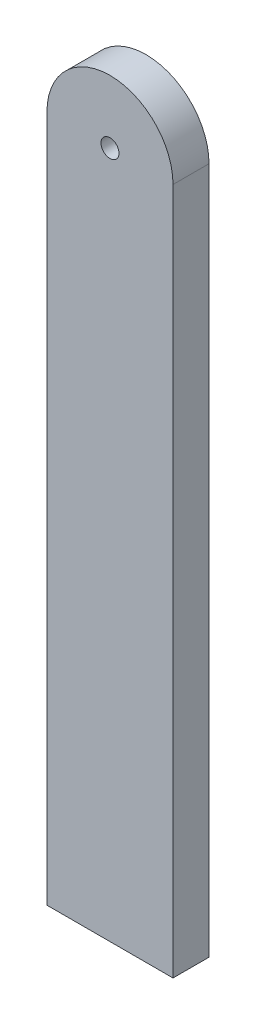
ISO-10303-21;
HEADER;
FILE_DESCRIPTION(('STEP AP214'),'2;1');
FILE_NAME('part.step','',(''),(''),'','','');
FILE_SCHEMA(('AUTOMOTIVE_DESIGN { 1 0 10303 214 1 1 1 1 }'));
ENDSEC;
DATA;
#1=APPLICATION_CONTEXT('core data for automotive mechanical design processes');
#2=APPLICATION_PROTOCOL_DEFINITION('international standard','automotive_design',2000,#1);
#3=PRODUCT_CONTEXT('',#1,'mechanical');
#4=PRODUCT('Part','Part','',(#3));
#5=PRODUCT_RELATED_PRODUCT_CATEGORY('part','',(#4));
#6=PRODUCT_DEFINITION_FORMATION('','',#4);
#7=PRODUCT_DEFINITION_CONTEXT('part definition',#1,'design');
#8=PRODUCT_DEFINITION('design','',#6,#7);
#9=PRODUCT_DEFINITION_SHAPE('','',#8);
#10=(LENGTH_UNIT() NAMED_UNIT(*) SI_UNIT(.MILLI.,.METRE.));
#11=(NAMED_UNIT(*) PLANE_ANGLE_UNIT() SI_UNIT($,.RADIAN.));
#12=(NAMED_UNIT(*) SI_UNIT($,.STERADIAN.) SOLID_ANGLE_UNIT());
#13=UNCERTAINTY_MEASURE_WITH_UNIT(LENGTH_MEASURE(1.E-05),#10,'distance_accuracy_value','');
#14=(GEOMETRIC_REPRESENTATION_CONTEXT(3) GLOBAL_UNCERTAINTY_ASSIGNED_CONTEXT((#13)) GLOBAL_UNIT_ASSIGNED_CONTEXT((#10,
#11,#12)) REPRESENTATION_CONTEXT('',''));
#15=CARTESIAN_POINT('',(0.,0.,0.));
#16=DIRECTION('',(0.,0.,1.));
#17=DIRECTION('',(1.,0.,0.));
#18=AXIS2_PLACEMENT_3D('',#15,#16,#17);
#19=CARTESIAN_POINT('',(0.,165.1,9.525));
#20=DIRECTION('',(0.,0.,-1.));
#21=DIRECTION('',(-1.,0.,0.));
#22=AXIS2_PLACEMENT_3D('',#19,#20,#21);
#23=PLANE('',#22);
#24=DIRECTION('',(0.,-1.,0.));
#25=VECTOR('',#24,1.);
#26=CARTESIAN_POINT('',(-33.3375,-198.4375,9.525));
#27=LINE('',#26,#25);
#28=CARTESIAN_POINT('',(-33.3375,165.1,9.525));
#29=VERTEX_POINT('',#28);
#30=CARTESIAN_POINT('',(-33.3375,-198.4375,9.525));
#31=VERTEX_POINT('',#30);
#32=EDGE_CURVE('E84',#29,#31,#27,.T.);
#33=ORIENTED_EDGE('',*,*,#32,.T.);
#34=DIRECTION('',(1.,0.,0.));
#35=VECTOR('',#34,1.);
#36=CARTESIAN_POINT('',(33.3375,-198.4375,9.525));
#37=LINE('',#36,#35);
#38=CARTESIAN_POINT('',(33.3375,-198.4375,9.525));
#39=VERTEX_POINT('',#38);
#40=EDGE_CURVE('E79',#31,#39,#37,.T.);
#41=ORIENTED_EDGE('',*,*,#40,.T.);
#42=DIRECTION('',(0.,1.,0.));
#43=VECTOR('',#42,1.);
#44=CARTESIAN_POINT('',(33.3375,165.1,9.525));
#45=LINE('',#44,#43);
#46=CARTESIAN_POINT('',(33.3375,165.1,9.525));
#47=VERTEX_POINT('',#46);
#48=EDGE_CURVE('E82',#39,#47,#45,.T.);
#49=ORIENTED_EDGE('',*,*,#48,.T.);
#50=CARTESIAN_POINT('',(0.,165.1,9.525));
#51=DIRECTION('',(0.,0.,1.));
#52=DIRECTION('',(-1.,0.,0.));
#53=AXIS2_PLACEMENT_3D('',#50,#51,#52);
#54=CIRCLE('',#53,33.3375);
#55=EDGE_CURVE('E49',#47,#29,#54,.T.);
#56=ORIENTED_EDGE('',*,*,#55,.T.);
#57=EDGE_LOOP('',(#33,#41,#49,#56));
#58=FACE_BOUND('',#57,.T.);
#59=CARTESIAN_POINT('',(0.,165.1,9.525));
#60=DIRECTION('',(0.,0.,1.));
#61=DIRECTION('',(1.,0.,0.));
#62=AXIS2_PLACEMENT_3D('',#59,#60,#61);
#63=CIRCLE('',#62,4.7625);
#64=CARTESIAN_POINT('',(4.7625,165.1,9.525));
#65=VERTEX_POINT('',#64);
#66=EDGE_CURVE('E99',#65,#65,#63,.T.);
#67=ORIENTED_EDGE('',*,*,#66,.F.);
#68=EDGE_LOOP('',(#67));
#69=FACE_BOUND('',#68,.T.);
#70=ADVANCED_FACE('F32',(#58,#69),#23,.F.);
#71=CARTESIAN_POINT('',(0.,165.1,-9.525));
#72=DIRECTION('',(0.,0.,-1.));
#73=DIRECTION('',(-1.,0.,0.));
#74=AXIS2_PLACEMENT_3D('',#71,#72,#73);
#75=PLANE('',#74);
#76=DIRECTION('',(0.,-1.,0.));
#77=VECTOR('',#76,1.);
#78=CARTESIAN_POINT('',(-33.3375,-198.4375,-9.525));
#79=LINE('',#78,#77);
#80=CARTESIAN_POINT('',(-33.3375,165.1,-9.525));
#81=VERTEX_POINT('',#80);
#82=CARTESIAN_POINT('',(-33.3375,-198.4375,-9.525));
#83=VERTEX_POINT('',#82);
#84=EDGE_CURVE('E96',#81,#83,#79,.T.);
#85=ORIENTED_EDGE('',*,*,#84,.F.);
#86=CARTESIAN_POINT('',(0.,165.1,-9.525));
#87=DIRECTION('',(0.,0.,1.));
#88=DIRECTION('',(-1.,0.,0.));
#89=AXIS2_PLACEMENT_3D('',#86,#87,#88);
#90=CIRCLE('',#89,33.3375);
#91=CARTESIAN_POINT('',(33.3375,165.1,-9.525));
#92=VERTEX_POINT('',#91);
#93=EDGE_CURVE('E72',#92,#81,#90,.T.);
#94=ORIENTED_EDGE('',*,*,#93,.F.);
#95=DIRECTION('',(0.,1.,0.));
#96=VECTOR('',#95,1.);
#97=CARTESIAN_POINT('',(33.3375,165.1,-9.525));
#98=LINE('',#97,#96);
#99=CARTESIAN_POINT('',(33.3375,-198.4375,-9.525));
#100=VERTEX_POINT('',#99);
#101=EDGE_CURVE('E66',#100,#92,#98,.T.);
#102=ORIENTED_EDGE('',*,*,#101,.F.);
#103=DIRECTION('',(1.,0.,0.));
#104=VECTOR('',#103,1.);
#105=CARTESIAN_POINT('',(33.3375,-198.4375,-9.525));
#106=LINE('',#105,#104);
#107=EDGE_CURVE('E88',#83,#100,#106,.T.);
#108=ORIENTED_EDGE('',*,*,#107,.F.);
#109=EDGE_LOOP('',(#85,#94,#102,#108));
#110=FACE_BOUND('',#109,.T.);
#111=CARTESIAN_POINT('',(0.,165.1,-9.525));
#112=DIRECTION('',(0.,0.,1.));
#113=DIRECTION('',(1.,0.,0.));
#114=AXIS2_PLACEMENT_3D('',#111,#112,#113);
#115=CIRCLE('',#114,4.7625);
#116=CARTESIAN_POINT('',(4.7625,165.1,-9.525));
#117=VERTEX_POINT('',#116);
#118=EDGE_CURVE('E111',#117,#117,#115,.T.);
#119=ORIENTED_EDGE('',*,*,#118,.T.);
#120=EDGE_LOOP('',(#119));
#121=FACE_BOUND('',#120,.T.);
#122=ADVANCED_FACE('F107',(#110,#121),#75,.T.);
#123=CARTESIAN_POINT('',(-33.3375,-198.4375,9.525));
#124=DIRECTION('',(1.,0.,0.));
#125=DIRECTION('',(0.,0.,-1.));
#126=AXIS2_PLACEMENT_3D('',#123,#124,#125);
#127=PLANE('',#126);
#128=ORIENTED_EDGE('',*,*,#84,.T.);
#129=DIRECTION('',(0.,0.,-1.));
#130=VECTOR('',#129,1.);
#131=CARTESIAN_POINT('',(-33.3375,-198.4375,9.525));
#132=LINE('',#131,#130);
#133=EDGE_CURVE('E11',#31,#83,#132,.T.);
#134=ORIENTED_EDGE('',*,*,#133,.F.);
#135=ORIENTED_EDGE('',*,*,#32,.F.);
#136=DIRECTION('',(0.,0.,-1.));
#137=VECTOR('',#136,1.);
#138=CARTESIAN_POINT('',(-33.3375,165.1,9.525));
#139=LINE('',#138,#137);
#140=EDGE_CURVE('E92',#29,#81,#139,.T.);
#141=ORIENTED_EDGE('',*,*,#140,.T.);
#142=EDGE_LOOP('',(#128,#134,#135,#141));
#143=FACE_BOUND('',#142,.T.);
#144=ADVANCED_FACE('F34',(#143),#127,.F.);
#145=CARTESIAN_POINT('',(33.3375,-198.4375,9.525));
#146=DIRECTION('',(0.,1.,0.));
#147=DIRECTION('',(0.,0.,1.));
#148=AXIS2_PLACEMENT_3D('',#145,#146,#147);
#149=PLANE('',#148);
#150=ORIENTED_EDGE('',*,*,#107,.T.);
#151=DIRECTION('',(0.,0.,-1.));
#152=VECTOR('',#151,1.);
#153=CARTESIAN_POINT('',(33.3375,-198.4375,9.525));
#154=LINE('',#153,#152);
#155=EDGE_CURVE('E41',#39,#100,#154,.T.);
#156=ORIENTED_EDGE('',*,*,#155,.F.);
#157=ORIENTED_EDGE('',*,*,#40,.F.);
#158=ORIENTED_EDGE('',*,*,#133,.T.);
#159=EDGE_LOOP('',(#150,#156,#157,#158));
#160=FACE_BOUND('',#159,.T.);
#161=ADVANCED_FACE('F87',(#160),#149,.F.);
#162=CARTESIAN_POINT('',(33.3375,165.1,9.525));
#163=DIRECTION('',(-1.,0.,0.));
#164=DIRECTION('',(0.,0.,1.));
#165=AXIS2_PLACEMENT_3D('',#162,#163,#164);
#166=PLANE('',#165);
#167=ORIENTED_EDGE('',*,*,#101,.T.);
#168=DIRECTION('',(0.,0.,-1.));
#169=VECTOR('',#168,1.);
#170=CARTESIAN_POINT('',(33.3375,165.1,9.525));
#171=LINE('',#170,#169);
#172=EDGE_CURVE('E89',#47,#92,#171,.T.);
#173=ORIENTED_EDGE('',*,*,#172,.F.);
#174=ORIENTED_EDGE('',*,*,#48,.F.);
#175=ORIENTED_EDGE('',*,*,#155,.T.);
#176=EDGE_LOOP('',(#167,#173,#174,#175));
#177=FACE_BOUND('',#176,.T.);
#178=ADVANCED_FACE('F90',(#177),#166,.F.);
#179=CARTESIAN_POINT('',(0.,165.1,9.525));
#180=DIRECTION('',(0.,0.,-1.));
#181=DIRECTION('',(-1.,0.,0.));
#182=AXIS2_PLACEMENT_3D('',#179,#180,#181);
#183=CYLINDRICAL_SURFACE('',#182,33.3375);
#184=ORIENTED_EDGE('',*,*,#93,.T.);
#185=ORIENTED_EDGE('',*,*,#140,.F.);
#186=ORIENTED_EDGE('',*,*,#55,.F.);
#187=ORIENTED_EDGE('',*,*,#172,.T.);
#188=EDGE_LOOP('',(#184,#185,#186,#187));
#189=FACE_BOUND('',#188,.T.);
#190=ADVANCED_FACE('F104',(#189),#183,.T.);
#191=CARTESIAN_POINT('',(0.,165.1,9.525));
#192=DIRECTION('',(0.,0.,-1.));
#193=DIRECTION('',(-1.,0.,0.));
#194=AXIS2_PLACEMENT_3D('',#191,#192,#193);
#195=CYLINDRICAL_SURFACE('',#194,4.7625);
#196=ORIENTED_EDGE('',*,*,#66,.T.);
#197=EDGE_LOOP('',(#196));
#198=FACE_BOUND('',#197,.T.);
#199=ORIENTED_EDGE('',*,*,#118,.F.);
#200=EDGE_LOOP('',(#199));
#201=FACE_BOUND('',#200,.T.);
#202=ADVANCED_FACE('F117',(#198,#201),#195,.F.);
#203=CLOSED_SHELL('',(#70,#122,#144,#161,#178,#190,#202));
#204=MANIFOLD_SOLID_BREP('B2',#203);
#205=ADVANCED_BREP_SHAPE_REPRESENTATION('',(#18,#204),#14);
#206=SHAPE_DEFINITION_REPRESENTATION(#9,#205);
ENDSEC;
END-ISO-10303-21;
